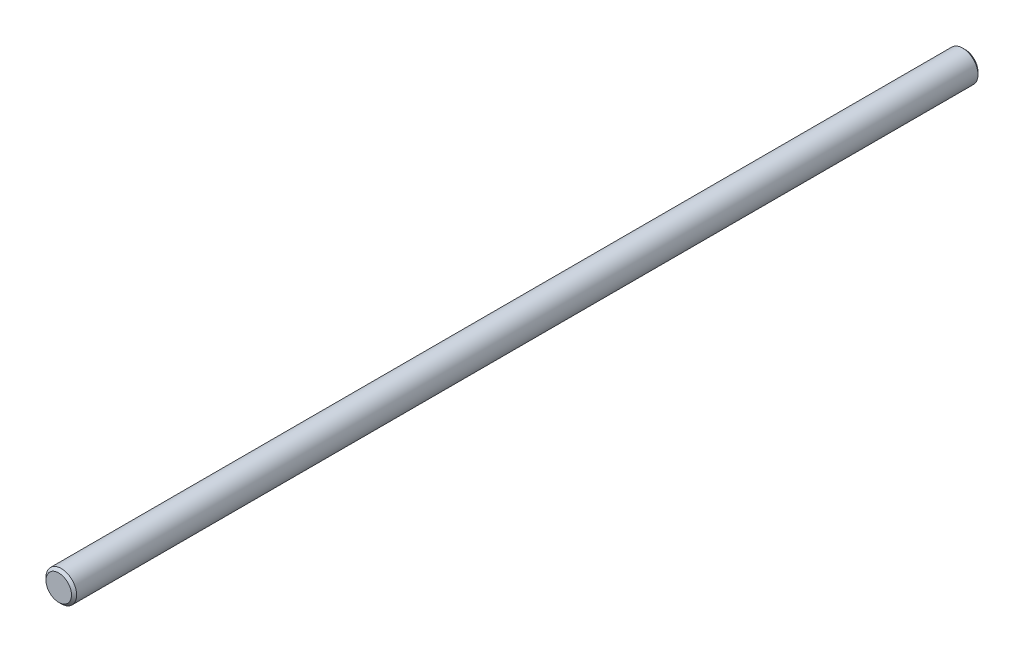
ISO-10303-21;
HEADER;
FILE_DESCRIPTION(('STEP AP214'),'2;1');
FILE_NAME('part.step','',(''),(''),'','','');
FILE_SCHEMA(('AUTOMOTIVE_DESIGN { 1 0 10303 214 1 1 1 1 }'));
ENDSEC;
DATA;
#1=APPLICATION_CONTEXT('core data for automotive mechanical design processes');
#2=APPLICATION_PROTOCOL_DEFINITION('international standard','automotive_design',2000,#1);
#3=PRODUCT_CONTEXT('',#1,'mechanical');
#4=PRODUCT('Part','Part','',(#3));
#5=PRODUCT_RELATED_PRODUCT_CATEGORY('part','',(#4));
#6=PRODUCT_DEFINITION_FORMATION('','',#4);
#7=PRODUCT_DEFINITION_CONTEXT('part definition',#1,'design');
#8=PRODUCT_DEFINITION('design','',#6,#7);
#9=PRODUCT_DEFINITION_SHAPE('','',#8);
#10=(LENGTH_UNIT() NAMED_UNIT(*) SI_UNIT(.MILLI.,.METRE.));
#11=(NAMED_UNIT(*) PLANE_ANGLE_UNIT() SI_UNIT($,.RADIAN.));
#12=(NAMED_UNIT(*) SI_UNIT($,.STERADIAN.) SOLID_ANGLE_UNIT());
#13=UNCERTAINTY_MEASURE_WITH_UNIT(LENGTH_MEASURE(1.E-05),#10,'distance_accuracy_value','');
#14=(GEOMETRIC_REPRESENTATION_CONTEXT(3) GLOBAL_UNCERTAINTY_ASSIGNED_CONTEXT((#13)) GLOBAL_UNIT_ASSIGNED_CONTEXT((#10,
#11,#12)) REPRESENTATION_CONTEXT('',''));
#15=CARTESIAN_POINT('',(0.,0.,0.));
#16=DIRECTION('',(0.,0.,1.));
#17=DIRECTION('',(1.,0.,0.));
#18=AXIS2_PLACEMENT_3D('',#15,#16,#17);
#19=CARTESIAN_POINT('',(0.,0.,355.));
#20=DIRECTION('',(0.,0.,-1.));
#21=DIRECTION('',(-1.,0.,0.));
#22=AXIS2_PLACEMENT_3D('',#19,#20,#21);
#23=CYLINDRICAL_SURFACE('',#22,6.);
#24=CARTESIAN_POINT('',(0.,0.,354.));
#25=DIRECTION('',(0.,0.,1.));
#26=DIRECTION('',(1.,0.,0.));
#27=AXIS2_PLACEMENT_3D('',#24,#25,#26);
#28=CIRCLE('',#27,6.);
#29=CARTESIAN_POINT('',(6.,0.,354.));
#30=VERTEX_POINT('',#29);
#31=EDGE_CURVE('E39',#30,#30,#28,.F.);
#32=ORIENTED_EDGE('',*,*,#31,.T.);
#33=EDGE_LOOP('',(#32));
#34=FACE_BOUND('',#33,.T.);
#35=CARTESIAN_POINT('',(0.,0.,1.00000000000011));
#36=DIRECTION('',(0.,0.,1.));
#37=DIRECTION('',(1.,0.,0.));
#38=AXIS2_PLACEMENT_3D('',#35,#36,#37);
#39=CIRCLE('',#38,6.);
#40=CARTESIAN_POINT('',(6.,0.,1.00000000000011));
#41=VERTEX_POINT('',#40);
#42=EDGE_CURVE('E43',#41,#41,#39,.T.);
#43=ORIENTED_EDGE('',*,*,#42,.T.);
#44=EDGE_LOOP('',(#43));
#45=FACE_BOUND('',#44,.T.);
#46=ADVANCED_FACE('F32',(#34,#45),#23,.T.);
#47=CARTESIAN_POINT('',(0.,0.,355.));
#48=DIRECTION('',(0.,0.,1.));
#49=DIRECTION('',(1.,0.,0.));
#50=AXIS2_PLACEMENT_3D('',#47,#48,#49);
#51=PLANE('',#50);
#52=CARTESIAN_POINT('',(0.,0.,355.));
#53=DIRECTION('',(0.,0.,1.));
#54=DIRECTION('',(1.,0.,0.));
#55=AXIS2_PLACEMENT_3D('',#52,#53,#54);
#56=CIRCLE('',#55,5.);
#57=CARTESIAN_POINT('',(5.,0.,355.));
#58=VERTEX_POINT('',#57);
#59=EDGE_CURVE('E47',#58,#58,#56,.T.);
#60=ORIENTED_EDGE('',*,*,#59,.T.);
#61=EDGE_LOOP('',(#60));
#62=FACE_BOUND('',#61,.T.);
#63=ADVANCED_FACE('F53',(#62),#51,.T.);
#64=CARTESIAN_POINT('',(0.,0.,0.));
#65=DIRECTION('',(0.,0.,1.));
#66=DIRECTION('',(1.,0.,0.));
#67=AXIS2_PLACEMENT_3D('',#64,#65,#66);
#68=PLANE('',#67);
#69=CARTESIAN_POINT('',(0.,0.,0.));
#70=DIRECTION('',(0.,0.,1.));
#71=DIRECTION('',(1.,0.,0.));
#72=AXIS2_PLACEMENT_3D('',#69,#70,#71);
#73=CIRCLE('',#72,4.99999999999987);
#74=CARTESIAN_POINT('',(4.99999999999987,0.,0.));
#75=VERTEX_POINT('',#74);
#76=EDGE_CURVE('E10',#75,#75,#73,.F.);
#77=ORIENTED_EDGE('',*,*,#76,.T.);
#78=EDGE_LOOP('',(#77));
#79=FACE_BOUND('',#78,.T.);
#80=ADVANCED_FACE('F57',(#79),#68,.F.);
#81=CARTESIAN_POINT('',(0.,0.,355.));
#82=DIRECTION('',(0.,0.,-1.));
#83=DIRECTION('',(-1.,0.,0.));
#84=AXIS2_PLACEMENT_3D('',#81,#82,#83);
#85=CONICAL_SURFACE('',#84,5.,0.785398163397446);
#86=ORIENTED_EDGE('',*,*,#31,.F.);
#87=EDGE_LOOP('',(#86));
#88=FACE_BOUND('',#87,.T.);
#89=ORIENTED_EDGE('',*,*,#59,.F.);
#90=EDGE_LOOP('',(#89));
#91=FACE_BOUND('',#90,.T.);
#92=ADVANCED_FACE('F55',(#88,#91),#85,.T.);
#93=CARTESIAN_POINT('',(0.,0.,1.00000000000011));
#94=DIRECTION('',(0.,0.,1.));
#95=DIRECTION('',(1.,0.,0.));
#96=AXIS2_PLACEMENT_3D('',#93,#94,#95);
#97=CONICAL_SURFACE('',#96,6.,0.78539816339746);
#98=ORIENTED_EDGE('',*,*,#76,.F.);
#99=EDGE_LOOP('',(#98));
#100=FACE_BOUND('',#99,.T.);
#101=ORIENTED_EDGE('',*,*,#42,.F.);
#102=EDGE_LOOP('',(#101));
#103=FACE_BOUND('',#102,.T.);
#104=ADVANCED_FACE('F34',(#100,#103),#97,.T.);
#105=CLOSED_SHELL('',(#46,#63,#80,#92,#104));
#106=MANIFOLD_SOLID_BREP('B2',#105);
#107=ADVANCED_BREP_SHAPE_REPRESENTATION('',(#18,#106),#14);
#108=SHAPE_DEFINITION_REPRESENTATION(#9,#107);
ENDSEC;
END-ISO-10303-21;
